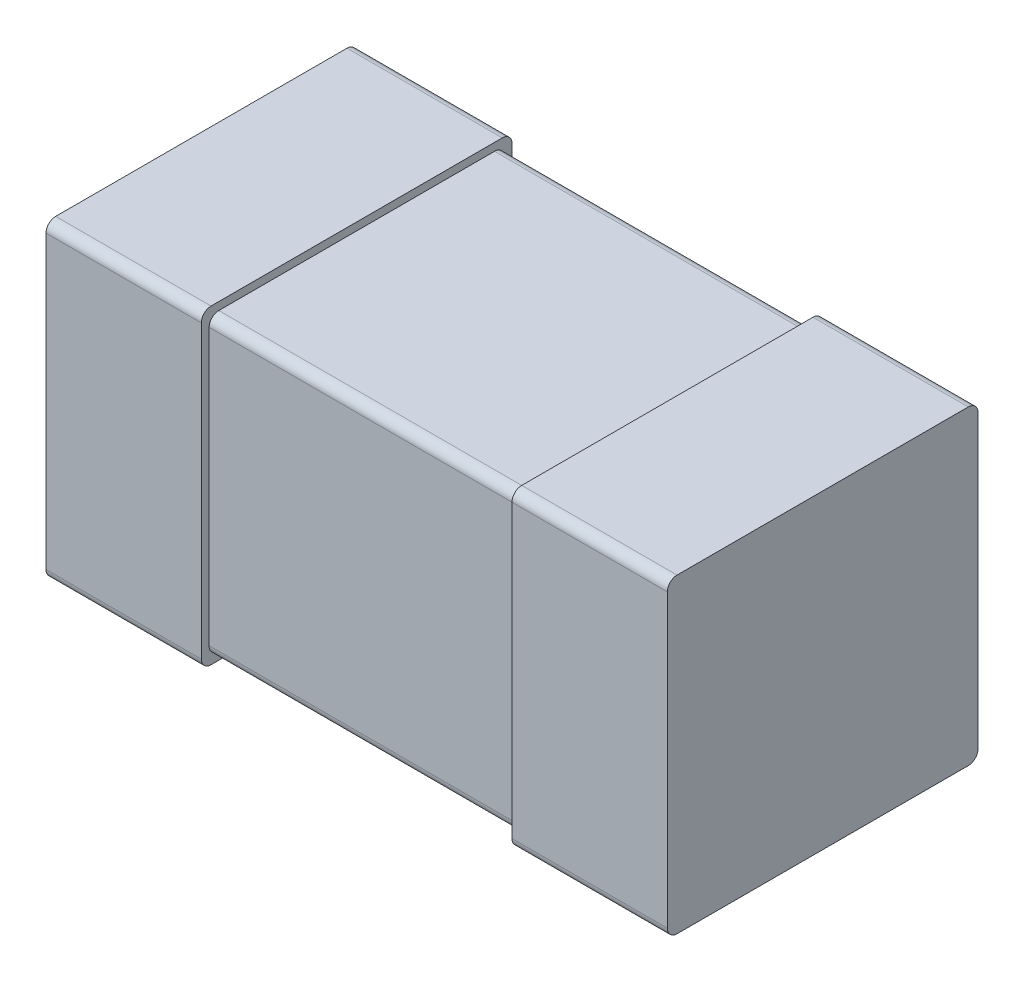
ISO-10303-21;
HEADER;
FILE_DESCRIPTION(('STEP AP214'),'2;1');
FILE_NAME('part.step','',(''),(''),'','','');
FILE_SCHEMA(('AUTOMOTIVE_DESIGN { 1 0 10303 214 1 1 1 1 }'));
ENDSEC;
DATA;
#1=APPLICATION_CONTEXT('core data for automotive mechanical design processes');
#2=APPLICATION_PROTOCOL_DEFINITION('international standard','automotive_design',2000,#1);
#3=PRODUCT_CONTEXT('',#1,'mechanical');
#4=PRODUCT('Part','Part','',(#3));
#5=PRODUCT_RELATED_PRODUCT_CATEGORY('part','',(#4));
#6=PRODUCT_DEFINITION_FORMATION('','',#4);
#7=PRODUCT_DEFINITION_CONTEXT('part definition',#1,'design');
#8=PRODUCT_DEFINITION('design','',#6,#7);
#9=PRODUCT_DEFINITION_SHAPE('','',#8);
#10=(LENGTH_UNIT() NAMED_UNIT(*) SI_UNIT(.MILLI.,.METRE.));
#11=(NAMED_UNIT(*) PLANE_ANGLE_UNIT() SI_UNIT($,.RADIAN.));
#12=(NAMED_UNIT(*) SI_UNIT($,.STERADIAN.) SOLID_ANGLE_UNIT());
#13=UNCERTAINTY_MEASURE_WITH_UNIT(LENGTH_MEASURE(1.E-05),#10,'distance_accuracy_value','');
#14=(GEOMETRIC_REPRESENTATION_CONTEXT(3) GLOBAL_UNCERTAINTY_ASSIGNED_CONTEXT((#13)) GLOBAL_UNIT_ASSIGNED_CONTEXT((#10,
#11,#12)) REPRESENTATION_CONTEXT('',''));
#15=CARTESIAN_POINT('',(0.,0.,0.));
#16=DIRECTION('',(0.,0.,1.));
#17=DIRECTION('',(1.,0.,0.));
#18=AXIS2_PLACEMENT_3D('',#15,#16,#17);
#19=CARTESIAN_POINT('',(0.8,-0.4,0.));
#20=DIRECTION('',(1.,0.,0.));
#21=DIRECTION('',(0.,0.,-1.));
#22=AXIS2_PLACEMENT_3D('',#19,#20,#21);
#23=PLANE('',#22);
#24=DIRECTION('',(0.,1.,0.));
#25=VECTOR('',#24,1.);
#26=CARTESIAN_POINT('',(0.8,-0.4,0.8));
#27=LINE('',#26,#25);
#28=CARTESIAN_POINT('',(0.8,-0.375,0.8));
#29=VERTEX_POINT('',#28);
#30=CARTESIAN_POINT('',(0.8,0.375,0.8));
#31=VERTEX_POINT('',#30);
#32=EDGE_CURVE('E200',#29,#31,#27,.T.);
#33=ORIENTED_EDGE('',*,*,#32,.F.);
#34=CARTESIAN_POINT('',(0.8,-0.375,0.775));
#35=DIRECTION('',(1.,0.,0.));
#36=DIRECTION('',(0.,0.,-1.));
#37=AXIS2_PLACEMENT_3D('',#34,#35,#36);
#38=CIRCLE('',#37,0.025);
#39=CARTESIAN_POINT('',(0.8,-0.4,0.775));
#40=VERTEX_POINT('',#39);
#41=EDGE_CURVE('E187',#40,#29,#38,.F.);
#42=ORIENTED_EDGE('',*,*,#41,.F.);
#43=DIRECTION('',(0.,0.,1.));
#44=VECTOR('',#43,1.);
#45=CARTESIAN_POINT('',(0.8,-0.4,0.));
#46=LINE('',#45,#44);
#47=CARTESIAN_POINT('',(0.8,-0.4,0.025));
#48=VERTEX_POINT('',#47);
#49=EDGE_CURVE('E184',#40,#48,#46,.F.);
#50=ORIENTED_EDGE('',*,*,#49,.T.);
#51=CARTESIAN_POINT('',(0.8,-0.375,0.025));
#52=DIRECTION('',(1.,0.,0.));
#53=DIRECTION('',(0.,0.,-1.));
#54=AXIS2_PLACEMENT_3D('',#51,#52,#53);
#55=CIRCLE('',#54,0.025);
#56=CARTESIAN_POINT('',(0.8,-0.375,0.));
#57=VERTEX_POINT('',#56);
#58=EDGE_CURVE('E20',#57,#48,#55,.F.);
#59=ORIENTED_EDGE('',*,*,#58,.F.);
#60=DIRECTION('',(0.,1.,0.));
#61=VECTOR('',#60,1.);
#62=CARTESIAN_POINT('',(0.8,-0.4,0.));
#63=LINE('',#62,#61);
#64=CARTESIAN_POINT('',(0.8,0.375,0.));
#65=VERTEX_POINT('',#64);
#66=EDGE_CURVE('E196',#57,#65,#63,.T.);
#67=ORIENTED_EDGE('',*,*,#66,.T.);
#68=CARTESIAN_POINT('',(0.8,0.375,0.025));
#69=DIRECTION('',(1.,0.,0.));
#70=DIRECTION('',(0.,0.,-1.));
#71=AXIS2_PLACEMENT_3D('',#68,#69,#70);
#72=CIRCLE('',#71,0.025);
#73=CARTESIAN_POINT('',(0.8,0.4,0.025));
#74=VERTEX_POINT('',#73);
#75=EDGE_CURVE('E208',#74,#65,#72,.F.);
#76=ORIENTED_EDGE('',*,*,#75,.F.);
#77=DIRECTION('',(0.,0.,1.));
#78=VECTOR('',#77,1.);
#79=CARTESIAN_POINT('',(0.8,0.4,0.));
#80=LINE('',#79,#78);
#81=CARTESIAN_POINT('',(0.8,0.4,0.775));
#82=VERTEX_POINT('',#81);
#83=EDGE_CURVE('E204',#82,#74,#80,.F.);
#84=ORIENTED_EDGE('',*,*,#83,.F.);
#85=CARTESIAN_POINT('',(0.8,0.375,0.775));
#86=DIRECTION('',(1.,0.,0.));
#87=DIRECTION('',(0.,0.,-1.));
#88=AXIS2_PLACEMENT_3D('',#85,#86,#87);
#89=CIRCLE('',#88,0.025);
#90=EDGE_CURVE('E282',#31,#82,#89,.F.);
#91=ORIENTED_EDGE('',*,*,#90,.F.);
#92=EDGE_LOOP('',(#33,#42,#50,#59,#67,#76,#84,#91));
#93=FACE_BOUND('',#92,.T.);
#94=ADVANCED_FACE('F17',(#93),#23,.T.);
#95=CARTESIAN_POINT('',(0.4,-0.4,0.));
#96=DIRECTION('',(0.,1.,0.));
#97=DIRECTION('',(0.,0.,1.));
#98=AXIS2_PLACEMENT_3D('',#95,#96,#97);
#99=PLANE('',#98);
#100=DIRECTION('',(0.,0.,-1.));
#101=VECTOR('',#100,1.);
#102=CARTESIAN_POINT('',(0.4,-0.4,0.));
#103=LINE('',#102,#101);
#104=CARTESIAN_POINT('',(0.4,-0.4,0.775));
#105=VERTEX_POINT('',#104);
#106=CARTESIAN_POINT('',(0.4,-0.4,0.025));
#107=VERTEX_POINT('',#106);
#108=EDGE_CURVE('E194',#105,#107,#103,.T.);
#109=ORIENTED_EDGE('',*,*,#108,.T.);
#110=DIRECTION('',(1.,0.,0.));
#111=VECTOR('',#110,1.);
#112=CARTESIAN_POINT('',(0.4,-0.4,0.025));
#113=LINE('',#112,#111);
#114=EDGE_CURVE('E181',#48,#107,#113,.F.);
#115=ORIENTED_EDGE('',*,*,#114,.F.);
#116=ORIENTED_EDGE('',*,*,#49,.F.);
#117=DIRECTION('',(1.,0.,0.));
#118=VECTOR('',#117,1.);
#119=CARTESIAN_POINT('',(0.4,-0.4,0.775));
#120=LINE('',#119,#118);
#121=EDGE_CURVE('E281',#105,#40,#120,.T.);
#122=ORIENTED_EDGE('',*,*,#121,.F.);
#123=EDGE_LOOP('',(#109,#115,#116,#122));
#124=FACE_BOUND('',#123,.T.);
#125=ADVANCED_FACE('F193',(#124),#99,.F.);
#126=CARTESIAN_POINT('',(0.4,-0.375,0.025));
#127=DIRECTION('',(1.,0.,0.));
#128=DIRECTION('',(0.,0.,-1.));
#129=AXIS2_PLACEMENT_3D('',#126,#127,#128);
#130=CYLINDRICAL_SURFACE('',#129,0.025);
#131=ORIENTED_EDGE('',*,*,#58,.T.);
#132=ORIENTED_EDGE('',*,*,#114,.T.);
#133=CARTESIAN_POINT('',(0.4,-0.375,0.025));
#134=DIRECTION('',(1.,0.,0.));
#135=DIRECTION('',(0.,0.,-1.));
#136=AXIS2_PLACEMENT_3D('',#133,#134,#135);
#137=CIRCLE('',#136,0.025);
#138=CARTESIAN_POINT('',(0.4,-0.375,0.));
#139=VERTEX_POINT('',#138);
#140=EDGE_CURVE('E277',#107,#139,#137,.T.);
#141=ORIENTED_EDGE('',*,*,#140,.T.);
#142=DIRECTION('',(1.,0.,0.));
#143=VECTOR('',#142,1.);
#144=CARTESIAN_POINT('',(0.4,-0.375,0.));
#145=LINE('',#144,#143);
#146=EDGE_CURVE('E183',#139,#57,#145,.T.);
#147=ORIENTED_EDGE('',*,*,#146,.T.);
#148=EDGE_LOOP('',(#131,#132,#141,#147));
#149=FACE_BOUND('',#148,.T.);
#150=ADVANCED_FACE('F178',(#149),#130,.T.);
#151=CARTESIAN_POINT('',(0.4,-0.4,0.));
#152=DIRECTION('',(0.,0.,1.));
#153=DIRECTION('',(1.,0.,0.));
#154=AXIS2_PLACEMENT_3D('',#151,#152,#153);
#155=PLANE('',#154);
#156=ORIENTED_EDGE('',*,*,#66,.F.);
#157=ORIENTED_EDGE('',*,*,#146,.F.);
#158=DIRECTION('',(0.,1.,0.));
#159=VECTOR('',#158,1.);
#160=CARTESIAN_POINT('',(0.4,-0.4,0.));
#161=LINE('',#160,#159);
#162=CARTESIAN_POINT('',(0.4,0.375,0.));
#163=VERTEX_POINT('',#162);
#164=EDGE_CURVE('E276',#139,#163,#161,.T.);
#165=ORIENTED_EDGE('',*,*,#164,.T.);
#166=DIRECTION('',(1.,0.,0.));
#167=VECTOR('',#166,1.);
#168=CARTESIAN_POINT('',(0.4,0.375,0.));
#169=LINE('',#168,#167);
#170=EDGE_CURVE('E207',#65,#163,#169,.F.);
#171=ORIENTED_EDGE('',*,*,#170,.F.);
#172=EDGE_LOOP('',(#156,#157,#165,#171));
#173=FACE_BOUND('',#172,.T.);
#174=ADVANCED_FACE('F474',(#173),#155,.F.);
#175=CARTESIAN_POINT('',(0.4,0.375,0.025));
#176=DIRECTION('',(1.,0.,0.));
#177=DIRECTION('',(0.,0.,-1.));
#178=AXIS2_PLACEMENT_3D('',#175,#176,#177);
#179=CYLINDRICAL_SURFACE('',#178,0.025);
#180=ORIENTED_EDGE('',*,*,#170,.T.);
#181=CARTESIAN_POINT('',(0.4,0.375,0.025));
#182=DIRECTION('',(1.,0.,0.));
#183=DIRECTION('',(0.,0.,-1.));
#184=AXIS2_PLACEMENT_3D('',#181,#182,#183);
#185=CIRCLE('',#184,0.025);
#186=CARTESIAN_POINT('',(0.4,0.4,0.025));
#187=VERTEX_POINT('',#186);
#188=EDGE_CURVE('E273',#163,#187,#185,.T.);
#189=ORIENTED_EDGE('',*,*,#188,.T.);
#190=DIRECTION('',(1.,0.,0.));
#191=VECTOR('',#190,1.);
#192=CARTESIAN_POINT('',(0.4,0.4,0.025));
#193=LINE('',#192,#191);
#194=EDGE_CURVE('E206',#74,#187,#193,.F.);
#195=ORIENTED_EDGE('',*,*,#194,.F.);
#196=ORIENTED_EDGE('',*,*,#75,.T.);
#197=EDGE_LOOP('',(#180,#189,#195,#196));
#198=FACE_BOUND('',#197,.T.);
#199=ADVANCED_FACE('F470',(#198),#179,.T.);
#200=CARTESIAN_POINT('',(0.4,0.4,0.));
#201=DIRECTION('',(0.,1.,0.));
#202=DIRECTION('',(0.,0.,1.));
#203=AXIS2_PLACEMENT_3D('',#200,#201,#202);
#204=PLANE('',#203);
#205=DIRECTION('',(0.,0.,-1.));
#206=VECTOR('',#205,1.);
#207=CARTESIAN_POINT('',(0.4,0.4,0.));
#208=LINE('',#207,#206);
#209=CARTESIAN_POINT('',(0.4,0.4,0.775));
#210=VERTEX_POINT('',#209);
#211=EDGE_CURVE('E272',#187,#210,#208,.F.);
#212=ORIENTED_EDGE('',*,*,#211,.T.);
#213=DIRECTION('',(1.,0.,0.));
#214=VECTOR('',#213,1.);
#215=CARTESIAN_POINT('',(0.4,0.4,0.775));
#216=LINE('',#215,#214);
#217=EDGE_CURVE('E202',#82,#210,#216,.F.);
#218=ORIENTED_EDGE('',*,*,#217,.F.);
#219=ORIENTED_EDGE('',*,*,#83,.T.);
#220=ORIENTED_EDGE('',*,*,#194,.T.);
#221=EDGE_LOOP('',(#212,#218,#219,#220));
#222=FACE_BOUND('',#221,.T.);
#223=ADVANCED_FACE('F466',(#222),#204,.T.);
#224=CARTESIAN_POINT('',(0.4,0.375,0.775));
#225=DIRECTION('',(1.,0.,0.));
#226=DIRECTION('',(0.,0.,-1.));
#227=AXIS2_PLACEMENT_3D('',#224,#225,#226);
#228=CYLINDRICAL_SURFACE('',#227,0.025);
#229=ORIENTED_EDGE('',*,*,#90,.T.);
#230=ORIENTED_EDGE('',*,*,#217,.T.);
#231=CARTESIAN_POINT('',(0.4,0.375,0.775));
#232=DIRECTION('',(1.,0.,0.));
#233=DIRECTION('',(0.,0.,-1.));
#234=AXIS2_PLACEMENT_3D('',#231,#232,#233);
#235=CIRCLE('',#234,0.025);
#236=CARTESIAN_POINT('',(0.4,0.375,0.8));
#237=VERTEX_POINT('',#236);
#238=EDGE_CURVE('E269',#210,#237,#235,.T.);
#239=ORIENTED_EDGE('',*,*,#238,.T.);
#240=DIRECTION('',(1.,0.,0.));
#241=VECTOR('',#240,1.);
#242=CARTESIAN_POINT('',(0.4,0.375,0.8));
#243=LINE('',#242,#241);
#244=EDGE_CURVE('E201',#31,#237,#243,.F.);
#245=ORIENTED_EDGE('',*,*,#244,.F.);
#246=EDGE_LOOP('',(#229,#230,#239,#245));
#247=FACE_BOUND('',#246,.T.);
#248=ADVANCED_FACE('F462',(#247),#228,.T.);
#249=CARTESIAN_POINT('',(0.4,-0.4,0.8));
#250=DIRECTION('',(0.,0.,1.));
#251=DIRECTION('',(1.,0.,0.));
#252=AXIS2_PLACEMENT_3D('',#249,#250,#251);
#253=PLANE('',#252);
#254=ORIENTED_EDGE('',*,*,#32,.T.);
#255=ORIENTED_EDGE('',*,*,#244,.T.);
#256=DIRECTION('',(0.,1.,0.));
#257=VECTOR('',#256,1.);
#258=CARTESIAN_POINT('',(0.4,-0.4,0.8));
#259=LINE('',#258,#257);
#260=CARTESIAN_POINT('',(0.4,-0.375,0.8));
#261=VERTEX_POINT('',#260);
#262=EDGE_CURVE('E268',#237,#261,#259,.F.);
#263=ORIENTED_EDGE('',*,*,#262,.T.);
#264=DIRECTION('',(1.,0.,0.));
#265=VECTOR('',#264,1.);
#266=CARTESIAN_POINT('',(0.4,-0.375,0.8));
#267=LINE('',#266,#265);
#268=EDGE_CURVE('E280',#29,#261,#267,.F.);
#269=ORIENTED_EDGE('',*,*,#268,.F.);
#270=EDGE_LOOP('',(#254,#255,#263,#269));
#271=FACE_BOUND('',#270,.T.);
#272=ADVANCED_FACE('F458',(#271),#253,.T.);
#273=CARTESIAN_POINT('',(0.4,-0.375,0.775));
#274=DIRECTION('',(1.,0.,0.));
#275=DIRECTION('',(0.,0.,-1.));
#276=AXIS2_PLACEMENT_3D('',#273,#274,#275);
#277=CYLINDRICAL_SURFACE('',#276,0.025);
#278=ORIENTED_EDGE('',*,*,#268,.T.);
#279=CARTESIAN_POINT('',(0.4,-0.375,0.775));
#280=DIRECTION('',(1.,0.,0.));
#281=DIRECTION('',(0.,0.,-1.));
#282=AXIS2_PLACEMENT_3D('',#279,#280,#281);
#283=CIRCLE('',#282,0.025);
#284=EDGE_CURVE('E265',#261,#105,#283,.T.);
#285=ORIENTED_EDGE('',*,*,#284,.T.);
#286=ORIENTED_EDGE('',*,*,#121,.T.);
#287=ORIENTED_EDGE('',*,*,#41,.T.);
#288=EDGE_LOOP('',(#278,#285,#286,#287));
#289=FACE_BOUND('',#288,.T.);
#290=ADVANCED_FACE('F454',(#289),#277,.T.);
#291=CARTESIAN_POINT('',(0.4,-0.4,0.));
#292=DIRECTION('',(1.,0.,0.));
#293=DIRECTION('',(0.,0.,-1.));
#294=AXIS2_PLACEMENT_3D('',#291,#292,#293);
#295=PLANE('',#294);
#296=CARTESIAN_POINT('',(0.4,0.355,0.045));
#297=DIRECTION('',(1.,0.,0.));
#298=DIRECTION('',(0.,0.,-1.));
#299=AXIS2_PLACEMENT_3D('',#296,#297,#298);
#300=CIRCLE('',#299,0.025);
#301=CARTESIAN_POINT('',(0.4,0.38,0.045));
#302=VERTEX_POINT('',#301);
#303=CARTESIAN_POINT('',(0.4,0.355,0.02));
#304=VERTEX_POINT('',#303);
#305=EDGE_CURVE('E250',#302,#304,#300,.F.);
#306=ORIENTED_EDGE('',*,*,#305,.F.);
#307=DIRECTION('',(0.,0.,1.));
#308=VECTOR('',#307,1.);
#309=CARTESIAN_POINT('',(0.4,0.38,0.02));
#310=LINE('',#309,#308);
#311=CARTESIAN_POINT('',(0.4,0.38,0.755));
#312=VERTEX_POINT('',#311);
#313=EDGE_CURVE('E256',#312,#302,#310,.F.);
#314=ORIENTED_EDGE('',*,*,#313,.F.);
#315=CARTESIAN_POINT('',(0.4,0.355,0.755));
#316=DIRECTION('',(1.,0.,0.));
#317=DIRECTION('',(0.,0.,-1.));
#318=AXIS2_PLACEMENT_3D('',#315,#316,#317);
#319=CIRCLE('',#318,0.025);
#320=CARTESIAN_POINT('',(0.4,0.355,0.78));
#321=VERTEX_POINT('',#320);
#322=EDGE_CURVE('E254',#321,#312,#319,.F.);
#323=ORIENTED_EDGE('',*,*,#322,.F.);
#324=DIRECTION('',(0.,1.,0.));
#325=VECTOR('',#324,1.);
#326=CARTESIAN_POINT('',(0.4,-0.38,0.78));
#327=LINE('',#326,#325);
#328=CARTESIAN_POINT('',(0.4,-0.355,0.78));
#329=VERTEX_POINT('',#328);
#330=EDGE_CURVE('E297',#329,#321,#327,.T.);
#331=ORIENTED_EDGE('',*,*,#330,.F.);
#332=CARTESIAN_POINT('',(0.4,-0.355,0.755));
#333=DIRECTION('',(1.,0.,0.));
#334=DIRECTION('',(0.,0.,-1.));
#335=AXIS2_PLACEMENT_3D('',#332,#333,#334);
#336=CIRCLE('',#335,0.025);
#337=CARTESIAN_POINT('',(0.4,-0.38,0.755));
#338=VERTEX_POINT('',#337);
#339=EDGE_CURVE('E258',#338,#329,#336,.F.);
#340=ORIENTED_EDGE('',*,*,#339,.F.);
#341=DIRECTION('',(0.,0.,1.));
#342=VECTOR('',#341,1.);
#343=CARTESIAN_POINT('',(0.4,-0.38,0.02));
#344=LINE('',#343,#342);
#345=CARTESIAN_POINT('',(0.4,-0.38,0.045));
#346=VERTEX_POINT('',#345);
#347=EDGE_CURVE('E264',#338,#346,#344,.F.);
#348=ORIENTED_EDGE('',*,*,#347,.T.);
#349=CARTESIAN_POINT('',(0.4,-0.355,0.045));
#350=DIRECTION('',(1.,0.,0.));
#351=DIRECTION('',(0.,0.,-1.));
#352=AXIS2_PLACEMENT_3D('',#349,#350,#351);
#353=CIRCLE('',#352,0.025);
#354=CARTESIAN_POINT('',(0.4,-0.355,0.02));
#355=VERTEX_POINT('',#354);
#356=EDGE_CURVE('E262',#355,#346,#353,.F.);
#357=ORIENTED_EDGE('',*,*,#356,.F.);
#358=DIRECTION('',(0.,1.,0.));
#359=VECTOR('',#358,1.);
#360=CARTESIAN_POINT('',(0.4,-0.38,0.02));
#361=LINE('',#360,#359);
#362=EDGE_CURVE('E308',#355,#304,#361,.T.);
#363=ORIENTED_EDGE('',*,*,#362,.T.);
#364=EDGE_LOOP('',(#306,#314,#323,#331,#340,#348,#357,#363));
#365=FACE_BOUND('',#364,.T.);
#366=ORIENTED_EDGE('',*,*,#262,.F.);
#367=ORIENTED_EDGE('',*,*,#238,.F.);
#368=ORIENTED_EDGE('',*,*,#211,.F.);
#369=ORIENTED_EDGE('',*,*,#188,.F.);
#370=ORIENTED_EDGE('',*,*,#164,.F.);
#371=ORIENTED_EDGE('',*,*,#140,.F.);
#372=ORIENTED_EDGE('',*,*,#108,.F.);
#373=ORIENTED_EDGE('',*,*,#284,.F.);
#374=EDGE_LOOP('',(#366,#367,#368,#369,#370,#371,#372,#373));
#375=FACE_BOUND('',#374,.T.);
#376=ADVANCED_FACE('F450',(#365,#375),#295,.F.);
#377=CARTESIAN_POINT('',(-0.4,-0.355,0.045));
#378=DIRECTION('',(1.,0.,0.));
#379=DIRECTION('',(0.,0.,-1.));
#380=AXIS2_PLACEMENT_3D('',#377,#378,#379);
#381=CYLINDRICAL_SURFACE('',#380,0.025);
#382=ORIENTED_EDGE('',*,*,#356,.T.);
#383=DIRECTION('',(1.,0.,0.));
#384=VECTOR('',#383,1.);
#385=CARTESIAN_POINT('',(-0.4,-0.38,0.045));
#386=LINE('',#385,#384);
#387=CARTESIAN_POINT('',(-0.4,-0.38,0.045));
#388=VERTEX_POINT('',#387);
#389=EDGE_CURVE('E296',#346,#388,#386,.F.);
#390=ORIENTED_EDGE('',*,*,#389,.T.);
#391=CARTESIAN_POINT('',(-0.4,-0.355,0.045));
#392=DIRECTION('',(1.,0.,0.));
#393=DIRECTION('',(0.,0.,-1.));
#394=AXIS2_PLACEMENT_3D('',#391,#392,#393);
#395=CIRCLE('',#394,0.025);
#396=CARTESIAN_POINT('',(-0.4,-0.355,0.02));
#397=VERTEX_POINT('',#396);
#398=EDGE_CURVE('E247',#397,#388,#395,.F.);
#399=ORIENTED_EDGE('',*,*,#398,.F.);
#400=DIRECTION('',(1.,0.,0.));
#401=VECTOR('',#400,1.);
#402=CARTESIAN_POINT('',(-0.4,-0.355,0.02));
#403=LINE('',#402,#401);
#404=EDGE_CURVE('E252',#397,#355,#403,.T.);
#405=ORIENTED_EDGE('',*,*,#404,.T.);
#406=EDGE_LOOP('',(#382,#390,#399,#405));
#407=FACE_BOUND('',#406,.T.);
#408=ADVANCED_FACE('F446',(#407),#381,.T.);
#409=CARTESIAN_POINT('',(-0.4,-0.38,0.02));
#410=DIRECTION('',(0.,1.,0.));
#411=DIRECTION('',(0.,0.,1.));
#412=AXIS2_PLACEMENT_3D('',#409,#410,#411);
#413=PLANE('',#412);
#414=DIRECTION('',(0.,0.,-1.));
#415=VECTOR('',#414,1.);
#416=CARTESIAN_POINT('',(-0.4,-0.38,0.));
#417=LINE('',#416,#415);
#418=CARTESIAN_POINT('',(-0.4,-0.38,0.755));
#419=VERTEX_POINT('',#418);
#420=EDGE_CURVE('E246',#388,#419,#417,.F.);
#421=ORIENTED_EDGE('',*,*,#420,.F.);
#422=ORIENTED_EDGE('',*,*,#389,.F.);
#423=ORIENTED_EDGE('',*,*,#347,.F.);
#424=DIRECTION('',(1.,0.,0.));
#425=VECTOR('',#424,1.);
#426=CARTESIAN_POINT('',(-0.4,-0.38,0.755));
#427=LINE('',#426,#425);
#428=EDGE_CURVE('E261',#419,#338,#427,.T.);
#429=ORIENTED_EDGE('',*,*,#428,.F.);
#430=EDGE_LOOP('',(#421,#422,#423,#429));
#431=FACE_BOUND('',#430,.T.);
#432=ADVANCED_FACE('F442',(#431),#413,.F.);
#433=CARTESIAN_POINT('',(-0.4,-0.355,0.755));
#434=DIRECTION('',(1.,0.,0.));
#435=DIRECTION('',(0.,0.,-1.));
#436=AXIS2_PLACEMENT_3D('',#433,#434,#435);
#437=CYLINDRICAL_SURFACE('',#436,0.025);
#438=DIRECTION('',(1.,0.,0.));
#439=VECTOR('',#438,1.);
#440=CARTESIAN_POINT('',(-0.4,-0.355,0.78));
#441=LINE('',#440,#439);
#442=CARTESIAN_POINT('',(-0.4,-0.355,0.78));
#443=VERTEX_POINT('',#442);
#444=EDGE_CURVE('E260',#443,#329,#441,.T.);
#445=ORIENTED_EDGE('',*,*,#444,.F.);
#446=CARTESIAN_POINT('',(-0.4,-0.355,0.755));
#447=DIRECTION('',(1.,0.,0.));
#448=DIRECTION('',(0.,0.,-1.));
#449=AXIS2_PLACEMENT_3D('',#446,#447,#448);
#450=CIRCLE('',#449,0.025);
#451=EDGE_CURVE('E244',#419,#443,#450,.F.);
#452=ORIENTED_EDGE('',*,*,#451,.F.);
#453=ORIENTED_EDGE('',*,*,#428,.T.);
#454=ORIENTED_EDGE('',*,*,#339,.T.);
#455=EDGE_LOOP('',(#445,#452,#453,#454));
#456=FACE_BOUND('',#455,.T.);
#457=ADVANCED_FACE('F438',(#456),#437,.T.);
#458=CARTESIAN_POINT('',(-0.4,-0.38,0.78));
#459=DIRECTION('',(0.,0.,1.));
#460=DIRECTION('',(1.,0.,0.));
#461=AXIS2_PLACEMENT_3D('',#458,#459,#460);
#462=PLANE('',#461);
#463=ORIENTED_EDGE('',*,*,#330,.T.);
#464=DIRECTION('',(1.,0.,0.));
#465=VECTOR('',#464,1.);
#466=CARTESIAN_POINT('',(-0.4,0.355,0.78));
#467=LINE('',#466,#465);
#468=CARTESIAN_POINT('',(-0.4,0.355,0.78));
#469=VERTEX_POINT('',#468);
#470=EDGE_CURVE('E257',#469,#321,#467,.T.);
#471=ORIENTED_EDGE('',*,*,#470,.F.);
#472=DIRECTION('',(0.,1.,0.));
#473=VECTOR('',#472,1.);
#474=CARTESIAN_POINT('',(-0.4,-0.4,0.78));
#475=LINE('',#474,#473);
#476=EDGE_CURVE('E243',#443,#469,#475,.T.);
#477=ORIENTED_EDGE('',*,*,#476,.F.);
#478=ORIENTED_EDGE('',*,*,#444,.T.);
#479=EDGE_LOOP('',(#463,#471,#477,#478));
#480=FACE_BOUND('',#479,.T.);
#481=ADVANCED_FACE('F434',(#480),#462,.T.);
#482=CARTESIAN_POINT('',(-0.4,0.355,0.755));
#483=DIRECTION('',(1.,0.,0.));
#484=DIRECTION('',(0.,0.,-1.));
#485=AXIS2_PLACEMENT_3D('',#482,#483,#484);
#486=CYLINDRICAL_SURFACE('',#485,0.025);
#487=ORIENTED_EDGE('',*,*,#322,.T.);
#488=DIRECTION('',(1.,0.,0.));
#489=VECTOR('',#488,1.);
#490=CARTESIAN_POINT('',(-0.4,0.38,0.755));
#491=LINE('',#490,#489);
#492=CARTESIAN_POINT('',(-0.4,0.38,0.755));
#493=VERTEX_POINT('',#492);
#494=EDGE_CURVE('E300',#493,#312,#491,.T.);
#495=ORIENTED_EDGE('',*,*,#494,.F.);
#496=CARTESIAN_POINT('',(-0.4,0.355,0.755));
#497=DIRECTION('',(1.,0.,0.));
#498=DIRECTION('',(0.,0.,-1.));
#499=AXIS2_PLACEMENT_3D('',#496,#497,#498);
#500=CIRCLE('',#499,0.025);
#501=EDGE_CURVE('E241',#469,#493,#500,.F.);
#502=ORIENTED_EDGE('',*,*,#501,.F.);
#503=ORIENTED_EDGE('',*,*,#470,.T.);
#504=EDGE_LOOP('',(#487,#495,#502,#503));
#505=FACE_BOUND('',#504,.T.);
#506=ADVANCED_FACE('F430',(#505),#486,.T.);
#507=CARTESIAN_POINT('',(-0.4,0.38,0.02));
#508=DIRECTION('',(0.,1.,0.));
#509=DIRECTION('',(0.,0.,1.));
#510=AXIS2_PLACEMENT_3D('',#507,#508,#509);
#511=PLANE('',#510);
#512=DIRECTION('',(0.,0.,-1.));
#513=VECTOR('',#512,1.);
#514=CARTESIAN_POINT('',(-0.4,0.38,0.));
#515=LINE('',#514,#513);
#516=CARTESIAN_POINT('',(-0.4,0.38,0.045));
#517=VERTEX_POINT('',#516);
#518=EDGE_CURVE('E240',#493,#517,#515,.T.);
#519=ORIENTED_EDGE('',*,*,#518,.F.);
#520=ORIENTED_EDGE('',*,*,#494,.T.);
#521=ORIENTED_EDGE('',*,*,#313,.T.);
#522=DIRECTION('',(1.,0.,0.));
#523=VECTOR('',#522,1.);
#524=CARTESIAN_POINT('',(-0.4,0.38,0.045));
#525=LINE('',#524,#523);
#526=EDGE_CURVE('E253',#517,#302,#525,.T.);
#527=ORIENTED_EDGE('',*,*,#526,.F.);
#528=EDGE_LOOP('',(#519,#520,#521,#527));
#529=FACE_BOUND('',#528,.T.);
#530=ADVANCED_FACE('F426',(#529),#511,.T.);
#531=CARTESIAN_POINT('',(-0.4,0.355,0.045));
#532=DIRECTION('',(1.,0.,0.));
#533=DIRECTION('',(0.,0.,-1.));
#534=AXIS2_PLACEMENT_3D('',#531,#532,#533);
#535=CYLINDRICAL_SURFACE('',#534,0.025);
#536=DIRECTION('',(1.,0.,0.));
#537=VECTOR('',#536,1.);
#538=CARTESIAN_POINT('',(-0.4,0.355,0.02));
#539=LINE('',#538,#537);
#540=CARTESIAN_POINT('',(-0.4,0.355,0.02));
#541=VERTEX_POINT('',#540);
#542=EDGE_CURVE('E249',#304,#541,#539,.F.);
#543=ORIENTED_EDGE('',*,*,#542,.T.);
#544=CARTESIAN_POINT('',(-0.4,0.355,0.045));
#545=DIRECTION('',(1.,0.,0.));
#546=DIRECTION('',(0.,0.,-1.));
#547=AXIS2_PLACEMENT_3D('',#544,#545,#546);
#548=CIRCLE('',#547,0.025);
#549=EDGE_CURVE('E237',#517,#541,#548,.F.);
#550=ORIENTED_EDGE('',*,*,#549,.F.);
#551=ORIENTED_EDGE('',*,*,#526,.T.);
#552=ORIENTED_EDGE('',*,*,#305,.T.);
#553=EDGE_LOOP('',(#543,#550,#551,#552));
#554=FACE_BOUND('',#553,.T.);
#555=ADVANCED_FACE('F422',(#554),#535,.T.);
#556=CARTESIAN_POINT('',(-0.4,-0.38,0.02));
#557=DIRECTION('',(0.,0.,1.));
#558=DIRECTION('',(1.,0.,0.));
#559=AXIS2_PLACEMENT_3D('',#556,#557,#558);
#560=PLANE('',#559);
#561=ORIENTED_EDGE('',*,*,#362,.F.);
#562=ORIENTED_EDGE('',*,*,#404,.F.);
#563=DIRECTION('',(0.,1.,0.));
#564=VECTOR('',#563,1.);
#565=CARTESIAN_POINT('',(-0.4,-0.4,0.02));
#566=LINE('',#565,#564);
#567=EDGE_CURVE('E239',#541,#397,#566,.F.);
#568=ORIENTED_EDGE('',*,*,#567,.F.);
#569=ORIENTED_EDGE('',*,*,#542,.F.);
#570=EDGE_LOOP('',(#561,#562,#568,#569));
#571=FACE_BOUND('',#570,.T.);
#572=ADVANCED_FACE('F418',(#571),#560,.F.);
#573=CARTESIAN_POINT('',(-0.4,-0.4,0.));
#574=DIRECTION('',(1.,0.,0.));
#575=DIRECTION('',(0.,0.,-1.));
#576=AXIS2_PLACEMENT_3D('',#573,#574,#575);
#577=PLANE('',#576);
#578=ORIENTED_EDGE('',*,*,#549,.T.);
#579=ORIENTED_EDGE('',*,*,#567,.T.);
#580=ORIENTED_EDGE('',*,*,#398,.T.);
#581=ORIENTED_EDGE('',*,*,#420,.T.);
#582=ORIENTED_EDGE('',*,*,#451,.T.);
#583=ORIENTED_EDGE('',*,*,#476,.T.);
#584=ORIENTED_EDGE('',*,*,#501,.T.);
#585=ORIENTED_EDGE('',*,*,#518,.T.);
#586=EDGE_LOOP('',(#578,#579,#580,#581,#582,#583,#584,#585));
#587=FACE_BOUND('',#586,.T.);
#588=DIRECTION('',(0.,1.,0.));
#589=VECTOR('',#588,1.);
#590=CARTESIAN_POINT('',(-0.4,-0.4,0.8));
#591=LINE('',#590,#589);
#592=CARTESIAN_POINT('',(-0.4,-0.375,0.8));
#593=VERTEX_POINT('',#592);
#594=CARTESIAN_POINT('',(-0.4,0.375,0.8));
#595=VERTEX_POINT('',#594);
#596=EDGE_CURVE('E339',#593,#595,#591,.T.);
#597=ORIENTED_EDGE('',*,*,#596,.F.);
#598=CARTESIAN_POINT('',(-0.4,-0.375,0.775));
#599=DIRECTION('',(1.,0.,0.));
#600=DIRECTION('',(0.,0.,-1.));
#601=AXIS2_PLACEMENT_3D('',#598,#599,#600);
#602=CIRCLE('',#601,0.025);
#603=CARTESIAN_POINT('',(-0.4,-0.4,0.775));
#604=VERTEX_POINT('',#603);
#605=EDGE_CURVE('E222',#604,#593,#602,.F.);
#606=ORIENTED_EDGE('',*,*,#605,.F.);
#607=DIRECTION('',(0.,0.,1.));
#608=VECTOR('',#607,1.);
#609=CARTESIAN_POINT('',(-0.4,-0.4,0.));
#610=LINE('',#609,#608);
#611=CARTESIAN_POINT('',(-0.4,-0.4,0.025));
#612=VERTEX_POINT('',#611);
#613=EDGE_CURVE('E236',#604,#612,#610,.F.);
#614=ORIENTED_EDGE('',*,*,#613,.T.);
#615=CARTESIAN_POINT('',(-0.4,-0.375,0.025));
#616=DIRECTION('',(1.,0.,0.));
#617=DIRECTION('',(0.,0.,-1.));
#618=AXIS2_PLACEMENT_3D('',#615,#616,#617);
#619=CIRCLE('',#618,0.025);
#620=CARTESIAN_POINT('',(-0.4,-0.375,0.));
#621=VERTEX_POINT('',#620);
#622=EDGE_CURVE('E233',#621,#612,#619,.F.);
#623=ORIENTED_EDGE('',*,*,#622,.F.);
#624=DIRECTION('',(0.,1.,0.));
#625=VECTOR('',#624,1.);
#626=CARTESIAN_POINT('',(-0.4,-0.4,0.));
#627=LINE('',#626,#625);
#628=CARTESIAN_POINT('',(-0.4,0.375,0.));
#629=VERTEX_POINT('',#628);
#630=EDGE_CURVE('E232',#621,#629,#627,.T.);
#631=ORIENTED_EDGE('',*,*,#630,.T.);
#632=CARTESIAN_POINT('',(-0.4,0.375,0.025));
#633=DIRECTION('',(1.,0.,0.));
#634=DIRECTION('',(0.,0.,-1.));
#635=AXIS2_PLACEMENT_3D('',#632,#633,#634);
#636=CIRCLE('',#635,0.025);
#637=CARTESIAN_POINT('',(-0.4,0.4,0.025));
#638=VERTEX_POINT('',#637);
#639=EDGE_CURVE('E229',#638,#629,#636,.F.);
#640=ORIENTED_EDGE('',*,*,#639,.F.);
#641=DIRECTION('',(0.,0.,1.));
#642=VECTOR('',#641,1.);
#643=CARTESIAN_POINT('',(-0.4,0.4,0.));
#644=LINE('',#643,#642);
#645=CARTESIAN_POINT('',(-0.4,0.4,0.775));
#646=VERTEX_POINT('',#645);
#647=EDGE_CURVE('E330',#646,#638,#644,.F.);
#648=ORIENTED_EDGE('',*,*,#647,.F.);
#649=CARTESIAN_POINT('',(-0.4,0.375,0.775));
#650=DIRECTION('',(1.,0.,0.));
#651=DIRECTION('',(0.,0.,-1.));
#652=AXIS2_PLACEMENT_3D('',#649,#650,#651);
#653=CIRCLE('',#652,0.025);
#654=EDGE_CURVE('E225',#595,#646,#653,.F.);
#655=ORIENTED_EDGE('',*,*,#654,.F.);
#656=EDGE_LOOP('',(#597,#606,#614,#623,#631,#640,#648,#655));
#657=FACE_BOUND('',#656,.T.);
#658=ADVANCED_FACE('F415',(#587,#657),#577,.T.);
#659=CARTESIAN_POINT('',(-0.8,-0.4,0.));
#660=DIRECTION('',(0.,1.,0.));
#661=DIRECTION('',(0.,0.,1.));
#662=AXIS2_PLACEMENT_3D('',#659,#660,#661);
#663=PLANE('',#662);
#664=DIRECTION('',(0.,0.,-1.));
#665=VECTOR('',#664,1.);
#666=CARTESIAN_POINT('',(-0.8,-0.4,0.));
#667=LINE('',#666,#665);
#668=CARTESIAN_POINT('',(-0.8,-0.4,0.775));
#669=VERTEX_POINT('',#668);
#670=CARTESIAN_POINT('',(-0.8,-0.4,0.025));
#671=VERTEX_POINT('',#670);
#672=EDGE_CURVE('E221',#669,#671,#667,.T.);
#673=ORIENTED_EDGE('',*,*,#672,.T.);
#674=DIRECTION('',(1.,0.,0.));
#675=VECTOR('',#674,1.);
#676=CARTESIAN_POINT('',(-0.8,-0.4,0.025));
#677=LINE('',#676,#675);
#678=EDGE_CURVE('E235',#612,#671,#677,.F.);
#679=ORIENTED_EDGE('',*,*,#678,.F.);
#680=ORIENTED_EDGE('',*,*,#613,.F.);
#681=DIRECTION('',(1.,0.,0.));
#682=VECTOR('',#681,1.);
#683=CARTESIAN_POINT('',(-0.8,-0.4,0.775));
#684=LINE('',#683,#682);
#685=EDGE_CURVE('E224',#669,#604,#684,.T.);
#686=ORIENTED_EDGE('',*,*,#685,.F.);
#687=EDGE_LOOP('',(#673,#679,#680,#686));
#688=FACE_BOUND('',#687,.T.);
#689=ADVANCED_FACE('F389',(#688),#663,.F.);
#690=CARTESIAN_POINT('',(-0.8,-0.375,0.025));
#691=DIRECTION('',(1.,0.,0.));
#692=DIRECTION('',(0.,0.,-1.));
#693=AXIS2_PLACEMENT_3D('',#690,#691,#692);
#694=CYLINDRICAL_SURFACE('',#693,0.025);
#695=ORIENTED_EDGE('',*,*,#622,.T.);
#696=ORIENTED_EDGE('',*,*,#678,.T.);
#697=CARTESIAN_POINT('',(-0.8,-0.375,0.025));
#698=DIRECTION('',(1.,0.,0.));
#699=DIRECTION('',(0.,0.,-1.));
#700=AXIS2_PLACEMENT_3D('',#697,#698,#699);
#701=CIRCLE('',#700,0.025);
#702=CARTESIAN_POINT('',(-0.8,-0.375,0.));
#703=VERTEX_POINT('',#702);
#704=EDGE_CURVE('E218',#671,#703,#701,.T.);
#705=ORIENTED_EDGE('',*,*,#704,.T.);
#706=DIRECTION('',(1.,0.,0.));
#707=VECTOR('',#706,1.);
#708=CARTESIAN_POINT('',(-0.8,-0.375,0.));
#709=LINE('',#708,#707);
#710=EDGE_CURVE('E329',#703,#621,#709,.T.);
#711=ORIENTED_EDGE('',*,*,#710,.T.);
#712=EDGE_LOOP('',(#695,#696,#705,#711));
#713=FACE_BOUND('',#712,.T.);
#714=ADVANCED_FACE('F386',(#713),#694,.T.);
#715=CARTESIAN_POINT('',(-0.8,-0.4,0.));
#716=DIRECTION('',(0.,0.,1.));
#717=DIRECTION('',(1.,0.,0.));
#718=AXIS2_PLACEMENT_3D('',#715,#716,#717);
#719=PLANE('',#718);
#720=ORIENTED_EDGE('',*,*,#630,.F.);
#721=ORIENTED_EDGE('',*,*,#710,.F.);
#722=DIRECTION('',(0.,1.,0.));
#723=VECTOR('',#722,1.);
#724=CARTESIAN_POINT('',(-0.8,-0.4,0.));
#725=LINE('',#724,#723);
#726=CARTESIAN_POINT('',(-0.8,0.375,0.));
#727=VERTEX_POINT('',#726);
#728=EDGE_CURVE('E217',#703,#727,#725,.T.);
#729=ORIENTED_EDGE('',*,*,#728,.T.);
#730=DIRECTION('',(1.,0.,0.));
#731=VECTOR('',#730,1.);
#732=CARTESIAN_POINT('',(-0.8,0.375,0.));
#733=LINE('',#732,#731);
#734=EDGE_CURVE('E231',#629,#727,#733,.F.);
#735=ORIENTED_EDGE('',*,*,#734,.F.);
#736=EDGE_LOOP('',(#720,#721,#729,#735));
#737=FACE_BOUND('',#736,.T.);
#738=ADVANCED_FACE('F383',(#737),#719,.F.);
#739=CARTESIAN_POINT('',(-0.8,0.375,0.025));
#740=DIRECTION('',(1.,0.,0.));
#741=DIRECTION('',(0.,0.,-1.));
#742=AXIS2_PLACEMENT_3D('',#739,#740,#741);
#743=CYLINDRICAL_SURFACE('',#742,0.025);
#744=ORIENTED_EDGE('',*,*,#734,.T.);
#745=CARTESIAN_POINT('',(-0.8,0.375,0.025));
#746=DIRECTION('',(1.,0.,0.));
#747=DIRECTION('',(0.,0.,-1.));
#748=AXIS2_PLACEMENT_3D('',#745,#746,#747);
#749=CIRCLE('',#748,0.025);
#750=CARTESIAN_POINT('',(-0.8,0.4,0.025));
#751=VERTEX_POINT('',#750);
#752=EDGE_CURVE('E214',#727,#751,#749,.T.);
#753=ORIENTED_EDGE('',*,*,#752,.T.);
#754=DIRECTION('',(1.,0.,0.));
#755=VECTOR('',#754,1.);
#756=CARTESIAN_POINT('',(-0.8,0.4,0.025));
#757=LINE('',#756,#755);
#758=EDGE_CURVE('E228',#638,#751,#757,.F.);
#759=ORIENTED_EDGE('',*,*,#758,.F.);
#760=ORIENTED_EDGE('',*,*,#639,.T.);
#761=EDGE_LOOP('',(#744,#753,#759,#760));
#762=FACE_BOUND('',#761,.T.);
#763=ADVANCED_FACE('F379',(#762),#743,.T.);
#764=CARTESIAN_POINT('',(-0.8,0.4,0.));
#765=DIRECTION('',(0.,1.,0.));
#766=DIRECTION('',(0.,0.,1.));
#767=AXIS2_PLACEMENT_3D('',#764,#765,#766);
#768=PLANE('',#767);
#769=DIRECTION('',(0.,0.,-1.));
#770=VECTOR('',#769,1.);
#771=CARTESIAN_POINT('',(-0.8,0.4,0.));
#772=LINE('',#771,#770);
#773=CARTESIAN_POINT('',(-0.8,0.4,0.775));
#774=VERTEX_POINT('',#773);
#775=EDGE_CURVE('E213',#751,#774,#772,.F.);
#776=ORIENTED_EDGE('',*,*,#775,.T.);
#777=DIRECTION('',(1.,0.,0.));
#778=VECTOR('',#777,1.);
#779=CARTESIAN_POINT('',(-0.8,0.4,0.775));
#780=LINE('',#779,#778);
#781=EDGE_CURVE('E227',#646,#774,#780,.F.);
#782=ORIENTED_EDGE('',*,*,#781,.F.);
#783=ORIENTED_EDGE('',*,*,#647,.T.);
#784=ORIENTED_EDGE('',*,*,#758,.T.);
#785=EDGE_LOOP('',(#776,#782,#783,#784));
#786=FACE_BOUND('',#785,.T.);
#787=ADVANCED_FACE('F373',(#786),#768,.T.);
#788=CARTESIAN_POINT('',(-0.8,0.375,0.775));
#789=DIRECTION('',(1.,0.,0.));
#790=DIRECTION('',(0.,0.,-1.));
#791=AXIS2_PLACEMENT_3D('',#788,#789,#790);
#792=CYLINDRICAL_SURFACE('',#791,0.025);
#793=ORIENTED_EDGE('',*,*,#654,.T.);
#794=ORIENTED_EDGE('',*,*,#781,.T.);
#795=CARTESIAN_POINT('',(-0.8,0.375,0.775));
#796=DIRECTION('',(1.,0.,0.));
#797=DIRECTION('',(0.,0.,-1.));
#798=AXIS2_PLACEMENT_3D('',#795,#796,#797);
#799=CIRCLE('',#798,0.025);
#800=CARTESIAN_POINT('',(-0.8,0.375,0.8));
#801=VERTEX_POINT('',#800);
#802=EDGE_CURVE('E210',#774,#801,#799,.T.);
#803=ORIENTED_EDGE('',*,*,#802,.T.);
#804=DIRECTION('',(1.,0.,0.));
#805=VECTOR('',#804,1.);
#806=CARTESIAN_POINT('',(-0.8,0.375,0.8));
#807=LINE('',#806,#805);
#808=EDGE_CURVE('E341',#595,#801,#807,.F.);
#809=ORIENTED_EDGE('',*,*,#808,.F.);
#810=EDGE_LOOP('',(#793,#794,#803,#809));
#811=FACE_BOUND('',#810,.T.);
#812=ADVANCED_FACE('F368',(#811),#792,.T.);
#813=CARTESIAN_POINT('',(-0.8,-0.4,0.8));
#814=DIRECTION('',(0.,0.,1.));
#815=DIRECTION('',(1.,0.,0.));
#816=AXIS2_PLACEMENT_3D('',#813,#814,#815);
#817=PLANE('',#816);
#818=ORIENTED_EDGE('',*,*,#596,.T.);
#819=ORIENTED_EDGE('',*,*,#808,.T.);
#820=DIRECTION('',(0.,1.,0.));
#821=VECTOR('',#820,1.);
#822=CARTESIAN_POINT('',(-0.8,-0.4,0.8));
#823=LINE('',#822,#821);
#824=CARTESIAN_POINT('',(-0.8,-0.375,0.8));
#825=VERTEX_POINT('',#824);
#826=EDGE_CURVE('E26',#801,#825,#823,.F.);
#827=ORIENTED_EDGE('',*,*,#826,.T.);
#828=DIRECTION('',(1.,0.,0.));
#829=VECTOR('',#828,1.);
#830=CARTESIAN_POINT('',(-0.8,-0.375,0.8));
#831=LINE('',#830,#829);
#832=EDGE_CURVE('E34',#593,#825,#831,.F.);
#833=ORIENTED_EDGE('',*,*,#832,.F.);
#834=EDGE_LOOP('',(#818,#819,#827,#833));
#835=FACE_BOUND('',#834,.T.);
#836=ADVANCED_FACE('F361',(#835),#817,.T.);
#837=CARTESIAN_POINT('',(-0.8,-0.375,0.775));
#838=DIRECTION('',(1.,0.,0.));
#839=DIRECTION('',(0.,0.,-1.));
#840=AXIS2_PLACEMENT_3D('',#837,#838,#839);
#841=CYLINDRICAL_SURFACE('',#840,0.025);
#842=ORIENTED_EDGE('',*,*,#832,.T.);
#843=CARTESIAN_POINT('',(-0.8,-0.375,0.775));
#844=DIRECTION('',(1.,0.,0.));
#845=DIRECTION('',(0.,0.,-1.));
#846=AXIS2_PLACEMENT_3D('',#843,#844,#845);
#847=CIRCLE('',#846,0.025);
#848=EDGE_CURVE('E11',#825,#669,#847,.T.);
#849=ORIENTED_EDGE('',*,*,#848,.T.);
#850=ORIENTED_EDGE('',*,*,#685,.T.);
#851=ORIENTED_EDGE('',*,*,#605,.T.);
#852=EDGE_LOOP('',(#842,#849,#850,#851));
#853=FACE_BOUND('',#852,.T.);
#854=ADVANCED_FACE('F392',(#853),#841,.T.);
#855=CARTESIAN_POINT('',(-0.8,-0.4,0.));
#856=DIRECTION('',(1.,0.,0.));
#857=DIRECTION('',(0.,0.,-1.));
#858=AXIS2_PLACEMENT_3D('',#855,#856,#857);
#859=PLANE('',#858);
#860=ORIENTED_EDGE('',*,*,#826,.F.);
#861=ORIENTED_EDGE('',*,*,#802,.F.);
#862=ORIENTED_EDGE('',*,*,#775,.F.);
#863=ORIENTED_EDGE('',*,*,#752,.F.);
#864=ORIENTED_EDGE('',*,*,#728,.F.);
#865=ORIENTED_EDGE('',*,*,#704,.F.);
#866=ORIENTED_EDGE('',*,*,#672,.F.);
#867=ORIENTED_EDGE('',*,*,#848,.F.);
#868=EDGE_LOOP('',(#860,#861,#862,#863,#864,#865,#866,#867));
#869=FACE_BOUND('',#868,.T.);
#870=ADVANCED_FACE('F365',(#869),#859,.F.);
#871=CLOSED_SHELL('',(#94,#125,#150,#174,#199,#223,#248,#272,#290,#376,#408,#432,#457,#481,#506,
#530,#555,#572,#658,#689,#714,#738,#763,#787,#812,#836,#854,#870));
#872=MANIFOLD_SOLID_BREP('B1',#871);
#873=ADVANCED_BREP_SHAPE_REPRESENTATION('',(#18,#872),#14);
#874=SHAPE_DEFINITION_REPRESENTATION(#9,#873);
ENDSEC;
END-ISO-10303-21;
